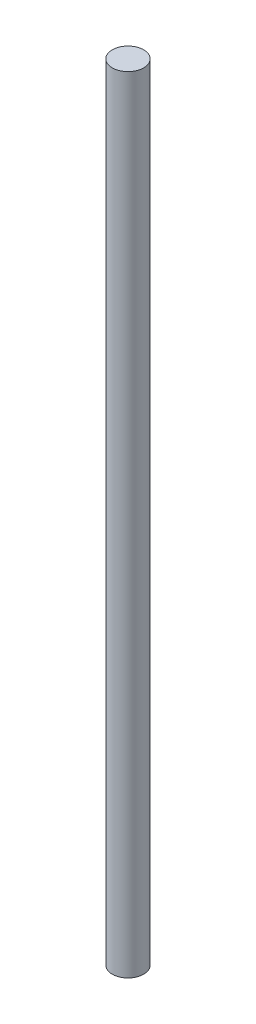
ISO-10303-21;
HEADER;
FILE_DESCRIPTION(('STEP AP214'),'2;1');
FILE_NAME('part.step','',(''),(''),'','','');
FILE_SCHEMA(('AUTOMOTIVE_DESIGN { 1 0 10303 214 1 1 1 1 }'));
ENDSEC;
DATA;
#1=APPLICATION_CONTEXT('core data for automotive mechanical design processes');
#2=APPLICATION_PROTOCOL_DEFINITION('international standard','automotive_design',2000,#1);
#3=PRODUCT_CONTEXT('',#1,'mechanical');
#4=PRODUCT('Part','Part','',(#3));
#5=PRODUCT_RELATED_PRODUCT_CATEGORY('part','',(#4));
#6=PRODUCT_DEFINITION_FORMATION('','',#4);
#7=PRODUCT_DEFINITION_CONTEXT('part definition',#1,'design');
#8=PRODUCT_DEFINITION('design','',#6,#7);
#9=PRODUCT_DEFINITION_SHAPE('','',#8);
#10=(LENGTH_UNIT() NAMED_UNIT(*) SI_UNIT(.MILLI.,.METRE.));
#11=(NAMED_UNIT(*) PLANE_ANGLE_UNIT() SI_UNIT($,.RADIAN.));
#12=(NAMED_UNIT(*) SI_UNIT($,.STERADIAN.) SOLID_ANGLE_UNIT());
#13=UNCERTAINTY_MEASURE_WITH_UNIT(LENGTH_MEASURE(1.E-05),#10,'distance_accuracy_value','');
#14=(GEOMETRIC_REPRESENTATION_CONTEXT(3) GLOBAL_UNCERTAINTY_ASSIGNED_CONTEXT((#13)) GLOBAL_UNIT_ASSIGNED_CONTEXT((#10,
#11,#12)) REPRESENTATION_CONTEXT('',''));
#15=CARTESIAN_POINT('',(0.,0.,0.));
#16=DIRECTION('',(0.,0.,1.));
#17=DIRECTION('',(1.,0.,0.));
#18=AXIS2_PLACEMENT_3D('',#15,#16,#17);
#19=CARTESIAN_POINT('',(0.,200.,0.));
#20=DIRECTION('',(0.,-1.,0.));
#21=DIRECTION('',(0.,0.,-1.));
#22=AXIS2_PLACEMENT_3D('',#19,#20,#21);
#23=CYLINDRICAL_SURFACE('',#22,4.);
#24=CARTESIAN_POINT('',(0.,200.,0.));
#25=DIRECTION('',(0.,1.,0.));
#26=DIRECTION('',(0.,0.,1.));
#27=AXIS2_PLACEMENT_3D('',#24,#25,#26);
#28=CIRCLE('',#27,4.);
#29=CARTESIAN_POINT('',(0.,200.,4.));
#30=VERTEX_POINT('',#29);
#31=EDGE_CURVE('E13',#30,#30,#28,.T.);
#32=ORIENTED_EDGE('',*,*,#31,.F.);
#33=EDGE_LOOP('',(#32));
#34=FACE_BOUND('',#33,.T.);
#35=CARTESIAN_POINT('',(0.,0.,0.));
#36=DIRECTION('',(0.,1.,0.));
#37=DIRECTION('',(0.,0.,1.));
#38=AXIS2_PLACEMENT_3D('',#35,#36,#37);
#39=CIRCLE('',#38,4.);
#40=CARTESIAN_POINT('',(0.,0.,4.));
#41=VERTEX_POINT('',#40);
#42=EDGE_CURVE('E54',#41,#41,#39,.T.);
#43=ORIENTED_EDGE('',*,*,#42,.T.);
#44=EDGE_LOOP('',(#43));
#45=FACE_BOUND('',#44,.T.);
#46=ADVANCED_FACE('F51',(#34,#45),#23,.T.);
#47=CARTESIAN_POINT('',(0.,200.,0.));
#48=DIRECTION('',(0.,1.,0.));
#49=DIRECTION('',(0.,0.,1.));
#50=AXIS2_PLACEMENT_3D('',#47,#48,#49);
#51=PLANE('',#50);
#52=ORIENTED_EDGE('',*,*,#31,.T.);
#53=EDGE_LOOP('',(#52));
#54=FACE_BOUND('',#53,.T.);
#55=ADVANCED_FACE('F80',(#54),#51,.T.);
#56=CARTESIAN_POINT('',(0.,0.,0.));
#57=DIRECTION('',(0.,1.,0.));
#58=DIRECTION('',(0.,0.,1.));
#59=AXIS2_PLACEMENT_3D('',#56,#57,#58);
#60=PLANE('',#59);
#61=CARTESIAN_POINT('',(0.,0.,0.));
#62=DIRECTION('',(0.,-1.,0.));
#63=DIRECTION('',(0.,0.,-1.));
#64=AXIS2_PLACEMENT_3D('',#61,#62,#63);
#65=CIRCLE('',#64,1.64999999999999);
#66=CARTESIAN_POINT('',(0.,0.,-1.64999999999999));
#67=VERTEX_POINT('',#66);
#68=EDGE_CURVE('E70',#67,#67,#65,.T.);
#69=ORIENTED_EDGE('',*,*,#68,.F.);
#70=EDGE_LOOP('',(#69));
#71=FACE_BOUND('',#70,.T.);
#72=ORIENTED_EDGE('',*,*,#42,.F.);
#73=EDGE_LOOP('',(#72));
#74=FACE_BOUND('',#73,.T.);
#75=ADVANCED_FACE('F64',(#71,#74),#60,.F.);
#76=CARTESIAN_POINT('',(0.,9.1,0.));
#77=DIRECTION('',(0.,-1.,0.));
#78=DIRECTION('',(0.,0.,-1.));
#79=AXIS2_PLACEMENT_3D('',#76,#77,#78);
#80=CONICAL_SURFACE('',#79,1.65,1.02974425867665);
#81=CARTESIAN_POINT('',(0.,10.0914200213955,0.));
#82=VERTEX_POINT('',#81);
#83=VERTEX_LOOP('',#82);
#84=FACE_BOUND('',#83,.T.);
#85=CARTESIAN_POINT('',(0.,9.1,0.));
#86=DIRECTION('',(0.,-1.,0.));
#87=DIRECTION('',(0.,0.,-1.));
#88=AXIS2_PLACEMENT_3D('',#85,#86,#87);
#89=CIRCLE('',#88,1.65);
#90=CARTESIAN_POINT('',(0.,9.1,-1.65));
#91=VERTEX_POINT('',#90);
#92=EDGE_CURVE('E68',#91,#91,#89,.T.);
#93=ORIENTED_EDGE('',*,*,#92,.T.);
#94=EDGE_LOOP('',(#93));
#95=FACE_BOUND('',#94,.T.);
#96=ADVANCED_FACE('F60',(#84,#95),#80,.F.);
#97=CARTESIAN_POINT('',(0.,0.,0.));
#98=DIRECTION('',(0.,-1.,0.));
#99=DIRECTION('',(0.,0.,-1.));
#100=AXIS2_PLACEMENT_3D('',#97,#98,#99);
#101=CYLINDRICAL_SURFACE('',#100,1.64999999999999);
#102=ORIENTED_EDGE('',*,*,#92,.F.);
#103=EDGE_LOOP('',(#102));
#104=FACE_BOUND('',#103,.T.);
#105=ORIENTED_EDGE('',*,*,#68,.T.);
#106=EDGE_LOOP('',(#105));
#107=FACE_BOUND('',#106,.T.);
#108=ADVANCED_FACE('F63',(#104,#107),#101,.F.);
#109=CLOSED_SHELL('',(#46,#55,#75,#96,#108));
#110=MANIFOLD_SOLID_BREP('B2',#109);
#111=ADVANCED_BREP_SHAPE_REPRESENTATION('',(#18,#110),#14);
#112=SHAPE_DEFINITION_REPRESENTATION(#9,#111);
ENDSEC;
END-ISO-10303-21;
